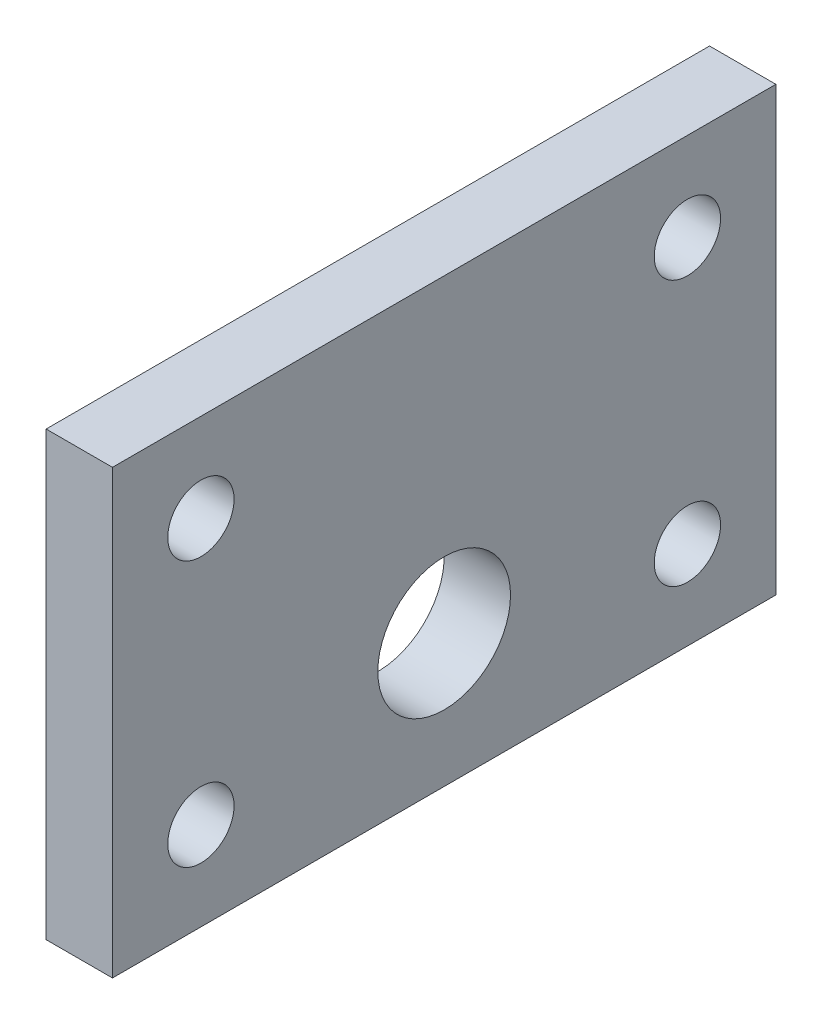
ISO-10303-21;
HEADER;
FILE_DESCRIPTION(('STEP AP214'),'2;1');
FILE_NAME('part.step','',(''),(''),'','','');
FILE_SCHEMA(('AUTOMOTIVE_DESIGN { 1 0 10303 214 1 1 1 1 }'));
ENDSEC;
DATA;
#1=APPLICATION_CONTEXT('core data for automotive mechanical design processes');
#2=APPLICATION_PROTOCOL_DEFINITION('international standard','automotive_design',2000,#1);
#3=PRODUCT_CONTEXT('',#1,'mechanical');
#4=PRODUCT('Part','Part','',(#3));
#5=PRODUCT_RELATED_PRODUCT_CATEGORY('part','',(#4));
#6=PRODUCT_DEFINITION_FORMATION('','',#4);
#7=PRODUCT_DEFINITION_CONTEXT('part definition',#1,'design');
#8=PRODUCT_DEFINITION('design','',#6,#7);
#9=PRODUCT_DEFINITION_SHAPE('','',#8);
#10=(LENGTH_UNIT() NAMED_UNIT(*) SI_UNIT(.MILLI.,.METRE.));
#11=(NAMED_UNIT(*) PLANE_ANGLE_UNIT() SI_UNIT($,.RADIAN.));
#12=(NAMED_UNIT(*) SI_UNIT($,.STERADIAN.) SOLID_ANGLE_UNIT());
#13=UNCERTAINTY_MEASURE_WITH_UNIT(LENGTH_MEASURE(1.E-05),#10,'distance_accuracy_value','');
#14=(GEOMETRIC_REPRESENTATION_CONTEXT(3) GLOBAL_UNCERTAINTY_ASSIGNED_CONTEXT((#13)) GLOBAL_UNIT_ASSIGNED_CONTEXT((#10,
#11,#12)) REPRESENTATION_CONTEXT('',''));
#15=CARTESIAN_POINT('',(0.,0.,0.));
#16=DIRECTION('',(0.,0.,1.));
#17=DIRECTION('',(1.,0.,0.));
#18=AXIS2_PLACEMENT_3D('',#15,#16,#17);
#19=CARTESIAN_POINT('',(3.,0.,0.));
#20=DIRECTION('',(1.,0.,0.));
#21=DIRECTION('',(0.,0.,-1.));
#22=AXIS2_PLACEMENT_3D('',#19,#20,#21);
#23=PLANE('',#22);
#24=CARTESIAN_POINT('',(3.,-4.,0.));
#25=DIRECTION('',(1.,0.,0.));
#26=DIRECTION('',(0.,0.,-1.));
#27=AXIS2_PLACEMENT_3D('',#24,#25,#26);
#28=CIRCLE('',#27,3.);
#29=CARTESIAN_POINT('',(3.,-4.,-3.));
#30=VERTEX_POINT('',#29);
#31=EDGE_CURVE('E136',#30,#30,#28,.F.);
#32=ORIENTED_EDGE('',*,*,#31,.T.);
#33=EDGE_LOOP('',(#32));
#34=FACE_BOUND('',#33,.T.);
#35=CARTESIAN_POINT('',(3.,-6.,-11.));
#36=DIRECTION('',(1.,0.,0.));
#37=DIRECTION('',(0.,0.,1.));
#38=AXIS2_PLACEMENT_3D('',#35,#36,#37);
#39=CIRCLE('',#38,1.5);
#40=CARTESIAN_POINT('',(3.,-6.,-9.49999999999999));
#41=VERTEX_POINT('',#40);
#42=EDGE_CURVE('E121',#41,#41,#39,.T.);
#43=ORIENTED_EDGE('',*,*,#42,.F.);
#44=EDGE_LOOP('',(#43));
#45=FACE_BOUND('',#44,.T.);
#46=CARTESIAN_POINT('',(3.,6.,11.));
#47=DIRECTION('',(1.,0.,0.));
#48=DIRECTION('',(0.,0.,-1.));
#49=AXIS2_PLACEMENT_3D('',#46,#47,#48);
#50=CIRCLE('',#49,1.5);
#51=CARTESIAN_POINT('',(3.,6.,9.50000000000001));
#52=VERTEX_POINT('',#51);
#53=EDGE_CURVE('E100',#52,#52,#50,.T.);
#54=ORIENTED_EDGE('',*,*,#53,.F.);
#55=EDGE_LOOP('',(#54));
#56=FACE_BOUND('',#55,.T.);
#57=DIRECTION('',(0.,-1.,0.));
#58=VECTOR('',#57,1.);
#59=CARTESIAN_POINT('',(3.,-9.99999999999999,15.));
#60=LINE('',#59,#58);
#61=CARTESIAN_POINT('',(3.,9.99999999999999,15.));
#62=VERTEX_POINT('',#61);
#63=CARTESIAN_POINT('',(3.,-9.99999999999999,15.));
#64=VERTEX_POINT('',#63);
#65=EDGE_CURVE('E85',#62,#64,#60,.T.);
#66=ORIENTED_EDGE('',*,*,#65,.T.);
#67=DIRECTION('',(0.,0.,-1.));
#68=VECTOR('',#67,1.);
#69=CARTESIAN_POINT('',(3.,-10.,-15.));
#70=LINE('',#69,#68);
#71=CARTESIAN_POINT('',(3.,-10.,-15.));
#72=VERTEX_POINT('',#71);
#73=EDGE_CURVE('E80',#64,#72,#70,.T.);
#74=ORIENTED_EDGE('',*,*,#73,.T.);
#75=DIRECTION('',(0.,1.,0.));
#76=VECTOR('',#75,1.);
#77=CARTESIAN_POINT('',(3.,-10.,-15.));
#78=LINE('',#77,#76);
#79=CARTESIAN_POINT('',(3.,10.,-15.));
#80=VERTEX_POINT('',#79);
#81=EDGE_CURVE('E83',#72,#80,#78,.T.);
#82=ORIENTED_EDGE('',*,*,#81,.T.);
#83=DIRECTION('',(0.,0.,1.));
#84=VECTOR('',#83,1.);
#85=CARTESIAN_POINT('',(3.,10.,-15.));
#86=LINE('',#85,#84);
#87=EDGE_CURVE('E50',#80,#62,#86,.T.);
#88=ORIENTED_EDGE('',*,*,#87,.T.);
#89=EDGE_LOOP('',(#66,#74,#82,#88));
#90=FACE_BOUND('',#89,.T.);
#91=CARTESIAN_POINT('',(3.,-6.,11.));
#92=DIRECTION('',(1.,0.,0.));
#93=DIRECTION('',(0.,0.,-1.));
#94=AXIS2_PLACEMENT_3D('',#91,#92,#93);
#95=CIRCLE('',#94,1.5);
#96=CARTESIAN_POINT('',(3.,-6.,9.50000000000002));
#97=VERTEX_POINT('',#96);
#98=EDGE_CURVE('E115',#97,#97,#95,.T.);
#99=ORIENTED_EDGE('',*,*,#98,.F.);
#100=EDGE_LOOP('',(#99));
#101=FACE_BOUND('',#100,.T.);
#102=CARTESIAN_POINT('',(3.,6.,-11.));
#103=DIRECTION('',(1.,0.,0.));
#104=DIRECTION('',(0.,0.,1.));
#105=AXIS2_PLACEMENT_3D('',#102,#103,#104);
#106=CIRCLE('',#105,1.5);
#107=CARTESIAN_POINT('',(3.,6.,-9.49999999999998));
#108=VERTEX_POINT('',#107);
#109=EDGE_CURVE('E127',#108,#108,#106,.T.);
#110=ORIENTED_EDGE('',*,*,#109,.F.);
#111=EDGE_LOOP('',(#110));
#112=FACE_BOUND('',#111,.T.);
#113=ADVANCED_FACE('F33',(#34,#45,#56,#90,#101,#112),#23,.T.);
#114=CARTESIAN_POINT('',(0.,0.,0.));
#115=DIRECTION('',(1.,0.,0.));
#116=DIRECTION('',(0.,0.,-1.));
#117=AXIS2_PLACEMENT_3D('',#114,#115,#116);
#118=PLANE('',#117);
#119=CARTESIAN_POINT('',(0.,-4.,0.));
#120=DIRECTION('',(-1.,0.,0.));
#121=DIRECTION('',(0.,0.,1.));
#122=AXIS2_PLACEMENT_3D('',#119,#120,#121);
#123=CIRCLE('',#122,3.);
#124=CARTESIAN_POINT('',(0.,-4.,3.));
#125=VERTEX_POINT('',#124);
#126=EDGE_CURVE('E133',#125,#125,#123,.T.);
#127=ORIENTED_EDGE('',*,*,#126,.F.);
#128=EDGE_LOOP('',(#127));
#129=FACE_BOUND('',#128,.T.);
#130=DIRECTION('',(0.,-1.,0.));
#131=VECTOR('',#130,1.);
#132=CARTESIAN_POINT('',(0.,-9.99999999999999,15.));
#133=LINE('',#132,#131);
#134=CARTESIAN_POINT('',(0.,9.99999999999999,15.));
#135=VERTEX_POINT('',#134);
#136=CARTESIAN_POINT('',(0.,-9.99999999999999,15.));
#137=VERTEX_POINT('',#136);
#138=EDGE_CURVE('E97',#135,#137,#133,.T.);
#139=ORIENTED_EDGE('',*,*,#138,.F.);
#140=DIRECTION('',(0.,0.,1.));
#141=VECTOR('',#140,1.);
#142=CARTESIAN_POINT('',(0.,10.,-15.));
#143=LINE('',#142,#141);
#144=CARTESIAN_POINT('',(0.,10.,-15.));
#145=VERTEX_POINT('',#144);
#146=EDGE_CURVE('E73',#145,#135,#143,.T.);
#147=ORIENTED_EDGE('',*,*,#146,.F.);
#148=DIRECTION('',(0.,1.,0.));
#149=VECTOR('',#148,1.);
#150=CARTESIAN_POINT('',(0.,-10.,-15.));
#151=LINE('',#150,#149);
#152=CARTESIAN_POINT('',(0.,-10.,-15.));
#153=VERTEX_POINT('',#152);
#154=EDGE_CURVE('E67',#153,#145,#151,.T.);
#155=ORIENTED_EDGE('',*,*,#154,.F.);
#156=DIRECTION('',(0.,0.,-1.));
#157=VECTOR('',#156,1.);
#158=CARTESIAN_POINT('',(0.,-10.,-15.));
#159=LINE('',#158,#157);
#160=EDGE_CURVE('E89',#137,#153,#159,.T.);
#161=ORIENTED_EDGE('',*,*,#160,.F.);
#162=EDGE_LOOP('',(#139,#147,#155,#161));
#163=FACE_BOUND('',#162,.T.);
#164=CARTESIAN_POINT('',(0.,6.,11.));
#165=DIRECTION('',(1.,0.,0.));
#166=DIRECTION('',(0.,0.,-1.));
#167=AXIS2_PLACEMENT_3D('',#164,#165,#166);
#168=CIRCLE('',#167,1.5);
#169=CARTESIAN_POINT('',(0.,6.,9.50000000000001));
#170=VERTEX_POINT('',#169);
#171=EDGE_CURVE('E112',#170,#170,#168,.T.);
#172=ORIENTED_EDGE('',*,*,#171,.T.);
#173=EDGE_LOOP('',(#172));
#174=FACE_BOUND('',#173,.T.);
#175=CARTESIAN_POINT('',(0.,-6.,11.));
#176=DIRECTION('',(1.,0.,0.));
#177=DIRECTION('',(0.,0.,-1.));
#178=AXIS2_PLACEMENT_3D('',#175,#176,#177);
#179=CIRCLE('',#178,1.5);
#180=CARTESIAN_POINT('',(0.,-6.,9.50000000000002));
#181=VERTEX_POINT('',#180);
#182=EDGE_CURVE('E118',#181,#181,#179,.T.);
#183=ORIENTED_EDGE('',*,*,#182,.T.);
#184=EDGE_LOOP('',(#183));
#185=FACE_BOUND('',#184,.T.);
#186=CARTESIAN_POINT('',(0.,-6.,-11.));
#187=DIRECTION('',(1.,0.,0.));
#188=DIRECTION('',(0.,0.,1.));
#189=AXIS2_PLACEMENT_3D('',#186,#187,#188);
#190=CIRCLE('',#189,1.5);
#191=CARTESIAN_POINT('',(0.,-6.,-9.49999999999999));
#192=VERTEX_POINT('',#191);
#193=EDGE_CURVE('E124',#192,#192,#190,.T.);
#194=ORIENTED_EDGE('',*,*,#193,.T.);
#195=EDGE_LOOP('',(#194));
#196=FACE_BOUND('',#195,.T.);
#197=CARTESIAN_POINT('',(0.,6.,-11.));
#198=DIRECTION('',(1.,0.,0.));
#199=DIRECTION('',(0.,0.,1.));
#200=AXIS2_PLACEMENT_3D('',#197,#198,#199);
#201=CIRCLE('',#200,1.5);
#202=CARTESIAN_POINT('',(0.,6.,-9.49999999999998));
#203=VERTEX_POINT('',#202);
#204=EDGE_CURVE('E130',#203,#203,#201,.T.);
#205=ORIENTED_EDGE('',*,*,#204,.T.);
#206=EDGE_LOOP('',(#205));
#207=FACE_BOUND('',#206,.T.);
#208=ADVANCED_FACE('F108',(#129,#163,#174,#185,#196,#207),#118,.F.);
#209=CARTESIAN_POINT('',(3.,-9.99999999999999,15.));
#210=DIRECTION('',(0.,0.,-1.));
#211=DIRECTION('',(-1.,0.,0.));
#212=AXIS2_PLACEMENT_3D('',#209,#210,#211);
#213=PLANE('',#212);
#214=ORIENTED_EDGE('',*,*,#138,.T.);
#215=DIRECTION('',(-1.,0.,0.));
#216=VECTOR('',#215,1.);
#217=CARTESIAN_POINT('',(3.,-9.99999999999999,15.));
#218=LINE('',#217,#216);
#219=EDGE_CURVE('E11',#64,#137,#218,.T.);
#220=ORIENTED_EDGE('',*,*,#219,.F.);
#221=ORIENTED_EDGE('',*,*,#65,.F.);
#222=DIRECTION('',(-1.,0.,0.));
#223=VECTOR('',#222,1.);
#224=CARTESIAN_POINT('',(3.,9.99999999999999,15.));
#225=LINE('',#224,#223);
#226=EDGE_CURVE('E93',#62,#135,#225,.T.);
#227=ORIENTED_EDGE('',*,*,#226,.T.);
#228=EDGE_LOOP('',(#214,#220,#221,#227));
#229=FACE_BOUND('',#228,.T.);
#230=ADVANCED_FACE('F35',(#229),#213,.F.);
#231=CARTESIAN_POINT('',(3.,-10.,-15.));
#232=DIRECTION('',(0.,1.,0.));
#233=DIRECTION('',(0.,0.,1.));
#234=AXIS2_PLACEMENT_3D('',#231,#232,#233);
#235=PLANE('',#234);
#236=ORIENTED_EDGE('',*,*,#160,.T.);
#237=DIRECTION('',(-1.,0.,0.));
#238=VECTOR('',#237,1.);
#239=CARTESIAN_POINT('',(3.,-10.,-15.));
#240=LINE('',#239,#238);
#241=EDGE_CURVE('E42',#72,#153,#240,.T.);
#242=ORIENTED_EDGE('',*,*,#241,.F.);
#243=ORIENTED_EDGE('',*,*,#73,.F.);
#244=ORIENTED_EDGE('',*,*,#219,.T.);
#245=EDGE_LOOP('',(#236,#242,#243,#244));
#246=FACE_BOUND('',#245,.T.);
#247=ADVANCED_FACE('F88',(#246),#235,.F.);
#248=CARTESIAN_POINT('',(3.,-10.,-15.));
#249=DIRECTION('',(0.,0.,1.));
#250=DIRECTION('',(1.,0.,0.));
#251=AXIS2_PLACEMENT_3D('',#248,#249,#250);
#252=PLANE('',#251);
#253=ORIENTED_EDGE('',*,*,#154,.T.);
#254=DIRECTION('',(-1.,0.,0.));
#255=VECTOR('',#254,1.);
#256=CARTESIAN_POINT('',(3.,10.,-15.));
#257=LINE('',#256,#255);
#258=EDGE_CURVE('E90',#80,#145,#257,.T.);
#259=ORIENTED_EDGE('',*,*,#258,.F.);
#260=ORIENTED_EDGE('',*,*,#81,.F.);
#261=ORIENTED_EDGE('',*,*,#241,.T.);
#262=EDGE_LOOP('',(#253,#259,#260,#261));
#263=FACE_BOUND('',#262,.T.);
#264=ADVANCED_FACE('F91',(#263),#252,.F.);
#265=CARTESIAN_POINT('',(3.,10.,-15.));
#266=DIRECTION('',(0.,-1.,0.));
#267=DIRECTION('',(0.,0.,-1.));
#268=AXIS2_PLACEMENT_3D('',#265,#266,#267);
#269=PLANE('',#268);
#270=ORIENTED_EDGE('',*,*,#146,.T.);
#271=ORIENTED_EDGE('',*,*,#226,.F.);
#272=ORIENTED_EDGE('',*,*,#87,.F.);
#273=ORIENTED_EDGE('',*,*,#258,.T.);
#274=EDGE_LOOP('',(#270,#271,#272,#273));
#275=FACE_BOUND('',#274,.T.);
#276=ADVANCED_FACE('F105',(#275),#269,.F.);
#277=CARTESIAN_POINT('',(3.,6.,11.));
#278=DIRECTION('',(-1.,0.,0.));
#279=DIRECTION('',(0.,0.,1.));
#280=AXIS2_PLACEMENT_3D('',#277,#278,#279);
#281=CYLINDRICAL_SURFACE('',#280,1.5);
#282=ORIENTED_EDGE('',*,*,#53,.T.);
#283=EDGE_LOOP('',(#282));
#284=FACE_BOUND('',#283,.T.);
#285=ORIENTED_EDGE('',*,*,#171,.F.);
#286=EDGE_LOOP('',(#285));
#287=FACE_BOUND('',#286,.T.);
#288=ADVANCED_FACE('F156',(#284,#287),#281,.F.);
#289=CARTESIAN_POINT('',(3.,-6.,11.));
#290=DIRECTION('',(-1.,0.,0.));
#291=DIRECTION('',(0.,0.,1.));
#292=AXIS2_PLACEMENT_3D('',#289,#290,#291);
#293=CYLINDRICAL_SURFACE('',#292,1.5);
#294=ORIENTED_EDGE('',*,*,#98,.T.);
#295=EDGE_LOOP('',(#294));
#296=FACE_BOUND('',#295,.T.);
#297=ORIENTED_EDGE('',*,*,#182,.F.);
#298=EDGE_LOOP('',(#297));
#299=FACE_BOUND('',#298,.T.);
#300=ADVANCED_FACE('F177',(#296,#299),#293,.F.);
#301=CARTESIAN_POINT('',(3.,-6.,-11.));
#302=DIRECTION('',(-1.,0.,0.));
#303=DIRECTION('',(0.,0.,1.));
#304=AXIS2_PLACEMENT_3D('',#301,#302,#303);
#305=CYLINDRICAL_SURFACE('',#304,1.5);
#306=ORIENTED_EDGE('',*,*,#42,.T.);
#307=EDGE_LOOP('',(#306));
#308=FACE_BOUND('',#307,.T.);
#309=ORIENTED_EDGE('',*,*,#193,.F.);
#310=EDGE_LOOP('',(#309));
#311=FACE_BOUND('',#310,.T.);
#312=ADVANCED_FACE('F184',(#308,#311),#305,.F.);
#313=CARTESIAN_POINT('',(3.,6.,-11.));
#314=DIRECTION('',(-1.,0.,0.));
#315=DIRECTION('',(0.,0.,1.));
#316=AXIS2_PLACEMENT_3D('',#313,#314,#315);
#317=CYLINDRICAL_SURFACE('',#316,1.5);
#318=ORIENTED_EDGE('',*,*,#109,.T.);
#319=EDGE_LOOP('',(#318));
#320=FACE_BOUND('',#319,.T.);
#321=ORIENTED_EDGE('',*,*,#204,.F.);
#322=EDGE_LOOP('',(#321));
#323=FACE_BOUND('',#322,.T.);
#324=ADVANCED_FACE('F192',(#320,#323),#317,.F.);
#325=CARTESIAN_POINT('',(3.001,-4.,0.));
#326=DIRECTION('',(-1.,0.,0.));
#327=DIRECTION('',(0.,0.,1.));
#328=AXIS2_PLACEMENT_3D('',#325,#326,#327);
#329=CYLINDRICAL_SURFACE('',#328,3.);
#330=ORIENTED_EDGE('',*,*,#31,.F.);
#331=EDGE_LOOP('',(#330));
#332=FACE_BOUND('',#331,.T.);
#333=ORIENTED_EDGE('',*,*,#126,.T.);
#334=EDGE_LOOP('',(#333));
#335=FACE_BOUND('',#334,.T.);
#336=ADVANCED_FACE('F142',(#332,#335),#329,.F.);
#337=CLOSED_SHELL('',(#113,#208,#230,#247,#264,#276,#288,#300,#312,#324,#336));
#338=MANIFOLD_SOLID_BREP('B2',#337);
#339=ADVANCED_BREP_SHAPE_REPRESENTATION('',(#18,#338),#14);
#340=SHAPE_DEFINITION_REPRESENTATION(#9,#339);
ENDSEC;
END-ISO-10303-21;
